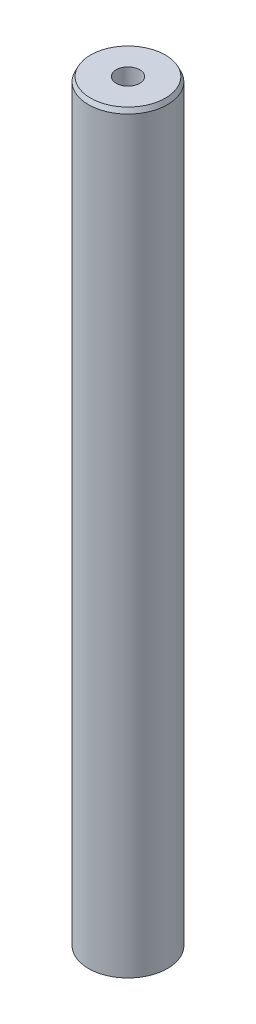
ISO-10303-21;
HEADER;
FILE_DESCRIPTION(('STEP AP214'),'2;1');
FILE_NAME('part.step','',(''),(''),'','','');
FILE_SCHEMA(('AUTOMOTIVE_DESIGN { 1 0 10303 214 1 1 1 1 }'));
ENDSEC;
DATA;
#1=APPLICATION_CONTEXT('core data for automotive mechanical design processes');
#2=APPLICATION_PROTOCOL_DEFINITION('international standard','automotive_design',2000,#1);
#3=PRODUCT_CONTEXT('',#1,'mechanical');
#4=PRODUCT('Part','Part','',(#3));
#5=PRODUCT_RELATED_PRODUCT_CATEGORY('part','',(#4));
#6=PRODUCT_DEFINITION_FORMATION('','',#4);
#7=PRODUCT_DEFINITION_CONTEXT('part definition',#1,'design');
#8=PRODUCT_DEFINITION('design','',#6,#7);
#9=PRODUCT_DEFINITION_SHAPE('','',#8);
#10=(LENGTH_UNIT() NAMED_UNIT(*) SI_UNIT(.MILLI.,.METRE.));
#11=(NAMED_UNIT(*) PLANE_ANGLE_UNIT() SI_UNIT($,.RADIAN.));
#12=(NAMED_UNIT(*) SI_UNIT($,.STERADIAN.) SOLID_ANGLE_UNIT());
#13=UNCERTAINTY_MEASURE_WITH_UNIT(LENGTH_MEASURE(1.E-05),#10,'distance_accuracy_value','');
#14=(GEOMETRIC_REPRESENTATION_CONTEXT(3) GLOBAL_UNCERTAINTY_ASSIGNED_CONTEXT((#13)) GLOBAL_UNIT_ASSIGNED_CONTEXT((#10,
#11,#12)) REPRESENTATION_CONTEXT('',''));
#15=CARTESIAN_POINT('',(0.,0.,0.));
#16=DIRECTION('',(0.,0.,1.));
#17=DIRECTION('',(1.,0.,0.));
#18=AXIS2_PLACEMENT_3D('',#15,#16,#17);
#19=CARTESIAN_POINT('',(0.,238.59204546849,0.));
#20=DIRECTION('',(0.,-1.,0.));
#21=DIRECTION('',(0.,0.,-1.));
#22=AXIS2_PLACEMENT_3D('',#19,#20,#21);
#23=CYLINDRICAL_SURFACE('',#22,12.5);
#24=CARTESIAN_POINT('',(0.,237.146785046501,0.));
#25=DIRECTION('',(0.,1.,0.));
#26=DIRECTION('',(0.,0.,1.));
#27=AXIS2_PLACEMENT_3D('',#24,#25,#26);
#28=CIRCLE('',#27,12.5);
#29=CARTESIAN_POINT('',(0.,237.146785046501,12.5));
#30=VERTEX_POINT('',#29);
#31=EDGE_CURVE('E50',#30,#30,#28,.F.);
#32=ORIENTED_EDGE('',*,*,#31,.T.);
#33=EDGE_LOOP('',(#32));
#34=FACE_BOUND('',#33,.T.);
#35=CARTESIAN_POINT('',(0.,0.677365396261759,0.));
#36=DIRECTION('',(0.,1.,0.));
#37=DIRECTION('',(0.,0.,1.));
#38=AXIS2_PLACEMENT_3D('',#35,#36,#37);
#39=CIRCLE('',#38,12.5);
#40=CARTESIAN_POINT('',(0.,0.677365396261759,12.5));
#41=VERTEX_POINT('',#40);
#42=EDGE_CURVE('E51',#41,#41,#39,.T.);
#43=ORIENTED_EDGE('',*,*,#42,.T.);
#44=EDGE_LOOP('',(#43));
#45=FACE_BOUND('',#44,.T.);
#46=ADVANCED_FACE('F39',(#34,#45),#23,.T.);
#47=CARTESIAN_POINT('',(0.,238.59204546849,0.));
#48=DIRECTION('',(0.,1.,0.));
#49=DIRECTION('',(0.,0.,1.));
#50=AXIS2_PLACEMENT_3D('',#47,#48,#49);
#51=PLANE('',#50);
#52=CARTESIAN_POINT('',(0.,238.59204546849,0.));
#53=DIRECTION('',(0.,1.,0.));
#54=DIRECTION('',(0.,0.,1.));
#55=AXIS2_PLACEMENT_3D('',#52,#53,#54);
#56=CIRCLE('',#55,11.8226346037383);
#57=CARTESIAN_POINT('',(0.,238.59204546849,11.8226346037383));
#58=VERTEX_POINT('',#57);
#59=EDGE_CURVE('E54',#58,#58,#56,.T.);
#60=ORIENTED_EDGE('',*,*,#59,.T.);
#61=EDGE_LOOP('',(#60));
#62=FACE_BOUND('',#61,.T.);
#63=CARTESIAN_POINT('',(0.,238.59204546849,0.));
#64=DIRECTION('',(0.,1.,0.));
#65=DIRECTION('',(0.,0.,1.));
#66=AXIS2_PLACEMENT_3D('',#63,#64,#65);
#67=CIRCLE('',#66,3.72657870078631);
#68=CARTESIAN_POINT('',(0.,238.59204546849,3.72657870078631));
#69=VERTEX_POINT('',#68);
#70=EDGE_CURVE('E58',#69,#69,#67,.T.);
#71=ORIENTED_EDGE('',*,*,#70,.F.);
#72=EDGE_LOOP('',(#71));
#73=FACE_BOUND('',#72,.T.);
#74=ADVANCED_FACE('F69',(#62,#73),#51,.T.);
#75=CARTESIAN_POINT('',(0.,0.,0.));
#76=DIRECTION('',(0.,1.,0.));
#77=DIRECTION('',(0.,0.,1.));
#78=AXIS2_PLACEMENT_3D('',#75,#76,#77);
#79=PLANE('',#78);
#80=CARTESIAN_POINT('',(0.,0.,0.));
#81=DIRECTION('',(0.,1.,0.));
#82=DIRECTION('',(0.,0.,1.));
#83=AXIS2_PLACEMENT_3D('',#80,#81,#82);
#84=CIRCLE('',#83,11.0547395780104);
#85=CARTESIAN_POINT('',(0.,0.,11.0547395780104));
#86=VERTEX_POINT('',#85);
#87=EDGE_CURVE('E10',#86,#86,#84,.F.);
#88=ORIENTED_EDGE('',*,*,#87,.T.);
#89=EDGE_LOOP('',(#88));
#90=FACE_BOUND('',#89,.T.);
#91=CARTESIAN_POINT('',(0.,0.,0.));
#92=DIRECTION('',(0.,1.,0.));
#93=DIRECTION('',(0.,0.,1.));
#94=AXIS2_PLACEMENT_3D('',#91,#92,#93);
#95=CIRCLE('',#94,3.72657870078631);
#96=CARTESIAN_POINT('',(0.,0.,3.72657870078631));
#97=VERTEX_POINT('',#96);
#98=EDGE_CURVE('E63',#97,#97,#95,.T.);
#99=ORIENTED_EDGE('',*,*,#98,.T.);
#100=EDGE_LOOP('',(#99));
#101=FACE_BOUND('',#100,.T.);
#102=ADVANCED_FACE('F75',(#90,#101),#79,.F.);
#103=CARTESIAN_POINT('',(0.,238.59204546849,0.));
#104=DIRECTION('',(0.,-1.,0.));
#105=DIRECTION('',(0.,0.,-1.));
#106=AXIS2_PLACEMENT_3D('',#103,#104,#105);
#107=CYLINDRICAL_SURFACE('',#106,3.72657870078631);
#108=ORIENTED_EDGE('',*,*,#70,.T.);
#109=EDGE_LOOP('',(#108));
#110=FACE_BOUND('',#109,.T.);
#111=ORIENTED_EDGE('',*,*,#98,.F.);
#112=EDGE_LOOP('',(#111));
#113=FACE_BOUND('',#112,.T.);
#114=ADVANCED_FACE('F70',(#110,#113),#107,.F.);
#115=CARTESIAN_POINT('',(0.,238.59204546849,0.));
#116=DIRECTION('',(0.,-1.,0.));
#117=DIRECTION('',(0.,0.,-1.));
#118=AXIS2_PLACEMENT_3D('',#115,#116,#117);
#119=CONICAL_SURFACE('',#118,11.8226346037383,0.438279589161156);
#120=ORIENTED_EDGE('',*,*,#31,.F.);
#121=EDGE_LOOP('',(#120));
#122=FACE_BOUND('',#121,.T.);
#123=ORIENTED_EDGE('',*,*,#59,.F.);
#124=EDGE_LOOP('',(#123));
#125=FACE_BOUND('',#124,.T.);
#126=ADVANCED_FACE('F81',(#122,#125),#119,.T.);
#127=CARTESIAN_POINT('',(0.,0.677365396261759,0.));
#128=DIRECTION('',(0.,1.,0.));
#129=DIRECTION('',(0.,0.,1.));
#130=AXIS2_PLACEMENT_3D('',#127,#128,#129);
#131=CONICAL_SURFACE('',#130,12.5,1.13251673763373);
#132=ORIENTED_EDGE('',*,*,#87,.F.);
#133=EDGE_LOOP('',(#132));
#134=FACE_BOUND('',#133,.T.);
#135=ORIENTED_EDGE('',*,*,#42,.F.);
#136=EDGE_LOOP('',(#135));
#137=FACE_BOUND('',#136,.T.);
#138=ADVANCED_FACE('F45',(#134,#137),#131,.T.);
#139=CLOSED_SHELL('',(#46,#74,#102,#114,#126,#138));
#140=MANIFOLD_SOLID_BREP('B2',#139);
#141=ADVANCED_BREP_SHAPE_REPRESENTATION('',(#18,#140),#14);
#142=SHAPE_DEFINITION_REPRESENTATION(#9,#141);
ENDSEC;
END-ISO-10303-21;
